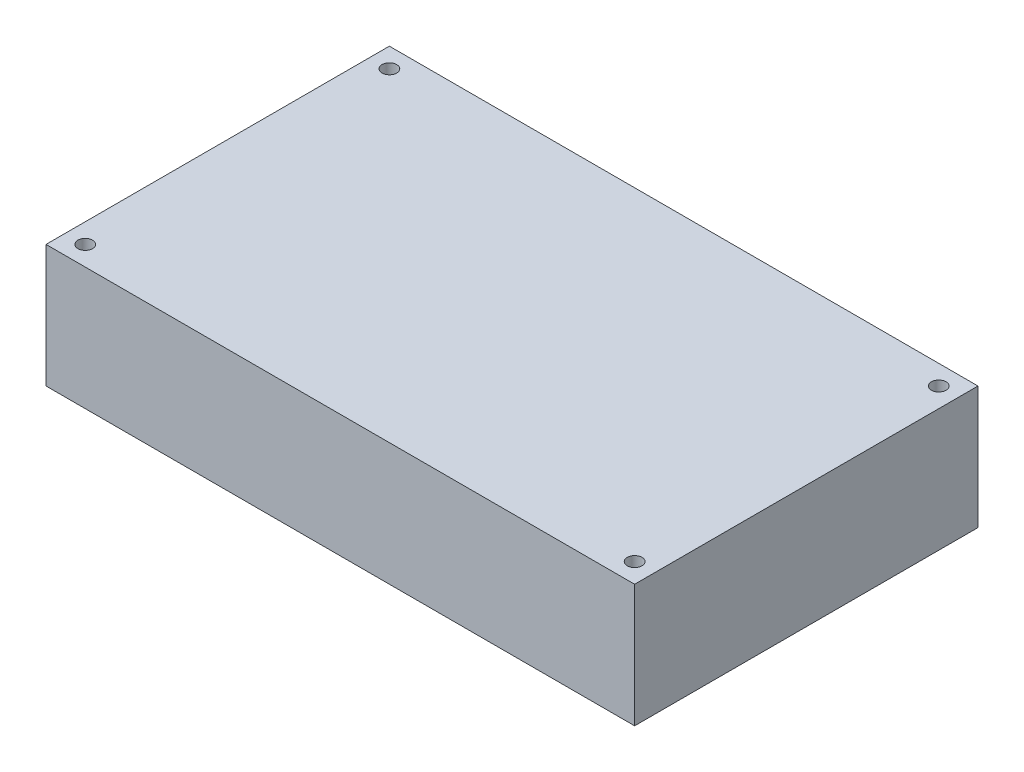
ISO-10303-21;
HEADER;
FILE_DESCRIPTION(('STEP AP214'),'2;1');
FILE_NAME('part.step','',(''),(''),'','','');
FILE_SCHEMA(('AUTOMOTIVE_DESIGN { 1 0 10303 214 1 1 1 1 }'));
ENDSEC;
DATA;
#1=APPLICATION_CONTEXT('core data for automotive mechanical design processes');
#2=APPLICATION_PROTOCOL_DEFINITION('international standard','automotive_design',2000,#1);
#3=PRODUCT_CONTEXT('',#1,'mechanical');
#4=PRODUCT('Part','Part','',(#3));
#5=PRODUCT_RELATED_PRODUCT_CATEGORY('part','',(#4));
#6=PRODUCT_DEFINITION_FORMATION('','',#4);
#7=PRODUCT_DEFINITION_CONTEXT('part definition',#1,'design');
#8=PRODUCT_DEFINITION('design','',#6,#7);
#9=PRODUCT_DEFINITION_SHAPE('','',#8);
#10=(LENGTH_UNIT() NAMED_UNIT(*) SI_UNIT(.MILLI.,.METRE.));
#11=(NAMED_UNIT(*) PLANE_ANGLE_UNIT() SI_UNIT($,.RADIAN.));
#12=(NAMED_UNIT(*) SI_UNIT($,.STERADIAN.) SOLID_ANGLE_UNIT());
#13=UNCERTAINTY_MEASURE_WITH_UNIT(LENGTH_MEASURE(1.E-05),#10,'distance_accuracy_value','');
#14=(GEOMETRIC_REPRESENTATION_CONTEXT(3) GLOBAL_UNCERTAINTY_ASSIGNED_CONTEXT((#13)) GLOBAL_UNIT_ASSIGNED_CONTEXT((#10,
#11,#12)) REPRESENTATION_CONTEXT('',''));
#15=CARTESIAN_POINT('',(0.,0.,0.));
#16=DIRECTION('',(0.,0.,1.));
#17=DIRECTION('',(1.,0.,0.));
#18=AXIS2_PLACEMENT_3D('',#15,#16,#17);
#19=CARTESIAN_POINT('',(60.,25.,-35.));
#20=DIRECTION('',(-1.,0.,0.));
#21=DIRECTION('',(0.,0.,1.));
#22=AXIS2_PLACEMENT_3D('',#19,#20,#21);
#23=PLANE('',#22);
#24=DIRECTION('',(0.,0.,-1.));
#25=VECTOR('',#24,1.);
#26=CARTESIAN_POINT('',(60.,0.,-35.));
#27=LINE('',#26,#25);
#28=CARTESIAN_POINT('',(60.,0.,35.));
#29=VERTEX_POINT('',#28);
#30=CARTESIAN_POINT('',(60.,0.,-35.));
#31=VERTEX_POINT('',#30);
#32=EDGE_CURVE('E104',#29,#31,#27,.T.);
#33=ORIENTED_EDGE('',*,*,#32,.T.);
#34=DIRECTION('',(0.,-1.,0.));
#35=VECTOR('',#34,1.);
#36=CARTESIAN_POINT('',(60.,25.,-35.));
#37=LINE('',#36,#35);
#38=CARTESIAN_POINT('',(60.,25.,-35.));
#39=VERTEX_POINT('',#38);
#40=EDGE_CURVE('E11',#39,#31,#37,.T.);
#41=ORIENTED_EDGE('',*,*,#40,.F.);
#42=DIRECTION('',(0.,0.,-1.));
#43=VECTOR('',#42,1.);
#44=CARTESIAN_POINT('',(60.,25.,-35.));
#45=LINE('',#44,#43);
#46=CARTESIAN_POINT('',(60.,25.,35.));
#47=VERTEX_POINT('',#46);
#48=EDGE_CURVE('E92',#47,#39,#45,.T.);
#49=ORIENTED_EDGE('',*,*,#48,.F.);
#50=DIRECTION('',(0.,-1.,0.));
#51=VECTOR('',#50,1.);
#52=CARTESIAN_POINT('',(60.,25.,35.));
#53=LINE('',#52,#51);
#54=EDGE_CURVE('E100',#47,#29,#53,.T.);
#55=ORIENTED_EDGE('',*,*,#54,.T.);
#56=EDGE_LOOP('',(#33,#41,#49,#55));
#57=FACE_BOUND('',#56,.T.);
#58=ADVANCED_FACE('F41',(#57),#23,.F.);
#59=CARTESIAN_POINT('',(-60.,25.,-35.));
#60=DIRECTION('',(0.,0.,1.));
#61=DIRECTION('',(1.,0.,0.));
#62=AXIS2_PLACEMENT_3D('',#59,#60,#61);
#63=PLANE('',#62);
#64=DIRECTION('',(-1.,0.,0.));
#65=VECTOR('',#64,1.);
#66=CARTESIAN_POINT('',(-60.,0.,-35.));
#67=LINE('',#66,#65);
#68=CARTESIAN_POINT('',(-60.,0.,-35.));
#69=VERTEX_POINT('',#68);
#70=EDGE_CURVE('E96',#31,#69,#67,.T.);
#71=ORIENTED_EDGE('',*,*,#70,.T.);
#72=DIRECTION('',(0.,-1.,0.));
#73=VECTOR('',#72,1.);
#74=CARTESIAN_POINT('',(-60.,25.,-35.));
#75=LINE('',#74,#73);
#76=CARTESIAN_POINT('',(-60.,25.,-35.));
#77=VERTEX_POINT('',#76);
#78=EDGE_CURVE('E49',#77,#69,#75,.T.);
#79=ORIENTED_EDGE('',*,*,#78,.F.);
#80=DIRECTION('',(-1.,0.,0.));
#81=VECTOR('',#80,1.);
#82=CARTESIAN_POINT('',(-60.,25.,-35.));
#83=LINE('',#82,#81);
#84=EDGE_CURVE('E87',#39,#77,#83,.T.);
#85=ORIENTED_EDGE('',*,*,#84,.F.);
#86=ORIENTED_EDGE('',*,*,#40,.T.);
#87=EDGE_LOOP('',(#71,#79,#85,#86));
#88=FACE_BOUND('',#87,.T.);
#89=ADVANCED_FACE('F95',(#88),#63,.F.);
#90=CARTESIAN_POINT('',(-60.,25.,-35.));
#91=DIRECTION('',(1.,0.,0.));
#92=DIRECTION('',(0.,0.,-1.));
#93=AXIS2_PLACEMENT_3D('',#90,#91,#92);
#94=PLANE('',#93);
#95=DIRECTION('',(0.,0.,1.));
#96=VECTOR('',#95,1.);
#97=CARTESIAN_POINT('',(-60.,0.,-35.));
#98=LINE('',#97,#96);
#99=CARTESIAN_POINT('',(-60.,0.,35.));
#100=VERTEX_POINT('',#99);
#101=EDGE_CURVE('E74',#69,#100,#98,.T.);
#102=ORIENTED_EDGE('',*,*,#101,.T.);
#103=DIRECTION('',(0.,-1.,0.));
#104=VECTOR('',#103,1.);
#105=CARTESIAN_POINT('',(-60.,25.,35.));
#106=LINE('',#105,#104);
#107=CARTESIAN_POINT('',(-60.,25.,35.));
#108=VERTEX_POINT('',#107);
#109=EDGE_CURVE('E97',#108,#100,#106,.T.);
#110=ORIENTED_EDGE('',*,*,#109,.F.);
#111=DIRECTION('',(0.,0.,1.));
#112=VECTOR('',#111,1.);
#113=CARTESIAN_POINT('',(-60.,25.,-35.));
#114=LINE('',#113,#112);
#115=EDGE_CURVE('E90',#77,#108,#114,.T.);
#116=ORIENTED_EDGE('',*,*,#115,.F.);
#117=ORIENTED_EDGE('',*,*,#78,.T.);
#118=EDGE_LOOP('',(#102,#110,#116,#117));
#119=FACE_BOUND('',#118,.T.);
#120=ADVANCED_FACE('F98',(#119),#94,.F.);
#121=CARTESIAN_POINT('',(-60.,25.,35.));
#122=DIRECTION('',(0.,0.,-1.));
#123=DIRECTION('',(-1.,0.,0.));
#124=AXIS2_PLACEMENT_3D('',#121,#122,#123);
#125=PLANE('',#124);
#126=DIRECTION('',(1.,0.,0.));
#127=VECTOR('',#126,1.);
#128=CARTESIAN_POINT('',(-60.,0.,35.));
#129=LINE('',#128,#127);
#130=EDGE_CURVE('E80',#100,#29,#129,.T.);
#131=ORIENTED_EDGE('',*,*,#130,.T.);
#132=ORIENTED_EDGE('',*,*,#54,.F.);
#133=DIRECTION('',(1.,0.,0.));
#134=VECTOR('',#133,1.);
#135=CARTESIAN_POINT('',(-60.,25.,35.));
#136=LINE('',#135,#134);
#137=EDGE_CURVE('E57',#108,#47,#136,.T.);
#138=ORIENTED_EDGE('',*,*,#137,.F.);
#139=ORIENTED_EDGE('',*,*,#109,.T.);
#140=EDGE_LOOP('',(#131,#132,#138,#139));
#141=FACE_BOUND('',#140,.T.);
#142=ADVANCED_FACE('F112',(#141),#125,.F.);
#143=CARTESIAN_POINT('',(0.,25.,0.));
#144=DIRECTION('',(0.,1.,0.));
#145=DIRECTION('',(0.,0.,1.));
#146=AXIS2_PLACEMENT_3D('',#143,#144,#145);
#147=PLANE('',#146);
#148=CARTESIAN_POINT('',(-56.,25.,31.));
#149=DIRECTION('',(0.,1.,0.));
#150=DIRECTION('',(0.,0.,1.));
#151=AXIS2_PLACEMENT_3D('',#148,#149,#150);
#152=CIRCLE('',#151,1.5);
#153=CARTESIAN_POINT('',(-56.,25.,32.5));
#154=VERTEX_POINT('',#153);
#155=EDGE_CURVE('E107',#154,#154,#152,.T.);
#156=ORIENTED_EDGE('',*,*,#155,.F.);
#157=EDGE_LOOP('',(#156));
#158=FACE_BOUND('',#157,.T.);
#159=CARTESIAN_POINT('',(56.,25.,31.));
#160=DIRECTION('',(0.,1.,0.));
#161=DIRECTION('',(0.,0.,1.));
#162=AXIS2_PLACEMENT_3D('',#159,#160,#161);
#163=CIRCLE('',#162,1.5);
#164=CARTESIAN_POINT('',(56.,25.,32.5));
#165=VERTEX_POINT('',#164);
#166=EDGE_CURVE('E120',#165,#165,#163,.T.);
#167=ORIENTED_EDGE('',*,*,#166,.F.);
#168=EDGE_LOOP('',(#167));
#169=FACE_BOUND('',#168,.T.);
#170=CARTESIAN_POINT('',(56.,25.,-31.));
#171=DIRECTION('',(0.,1.,0.));
#172=DIRECTION('',(0.,0.,1.));
#173=AXIS2_PLACEMENT_3D('',#170,#171,#172);
#174=CIRCLE('',#173,1.5);
#175=CARTESIAN_POINT('',(56.,25.,-29.5));
#176=VERTEX_POINT('',#175);
#177=EDGE_CURVE('E123',#176,#176,#174,.T.);
#178=ORIENTED_EDGE('',*,*,#177,.F.);
#179=EDGE_LOOP('',(#178));
#180=FACE_BOUND('',#179,.T.);
#181=CARTESIAN_POINT('',(-56.,25.,-31.));
#182=DIRECTION('',(0.,1.,0.));
#183=DIRECTION('',(0.,0.,1.));
#184=AXIS2_PLACEMENT_3D('',#181,#182,#183);
#185=CIRCLE('',#184,1.5);
#186=CARTESIAN_POINT('',(-56.,25.,-29.5));
#187=VERTEX_POINT('',#186);
#188=EDGE_CURVE('E126',#187,#187,#185,.T.);
#189=ORIENTED_EDGE('',*,*,#188,.F.);
#190=EDGE_LOOP('',(#189));
#191=FACE_BOUND('',#190,.T.);
#192=ORIENTED_EDGE('',*,*,#48,.T.);
#193=ORIENTED_EDGE('',*,*,#84,.T.);
#194=ORIENTED_EDGE('',*,*,#115,.T.);
#195=ORIENTED_EDGE('',*,*,#137,.T.);
#196=EDGE_LOOP('',(#192,#193,#194,#195));
#197=FACE_BOUND('',#196,.T.);
#198=ADVANCED_FACE('F88',(#158,#169,#180,#191,#197),#147,.T.);
#199=CARTESIAN_POINT('',(0.,0.,0.));
#200=DIRECTION('',(0.,1.,0.));
#201=DIRECTION('',(0.,0.,1.));
#202=AXIS2_PLACEMENT_3D('',#199,#200,#201);
#203=PLANE('',#202);
#204=CARTESIAN_POINT('',(-56.,0.,31.));
#205=DIRECTION('',(0.,1.,0.));
#206=DIRECTION('',(0.,0.,1.));
#207=AXIS2_PLACEMENT_3D('',#204,#205,#206);
#208=CIRCLE('',#207,1.5);
#209=CARTESIAN_POINT('',(-56.,0.,32.5));
#210=VERTEX_POINT('',#209);
#211=EDGE_CURVE('E133',#210,#210,#208,.T.);
#212=ORIENTED_EDGE('',*,*,#211,.T.);
#213=EDGE_LOOP('',(#212));
#214=FACE_BOUND('',#213,.T.);
#215=CARTESIAN_POINT('',(56.,0.,31.));
#216=DIRECTION('',(0.,1.,0.));
#217=DIRECTION('',(0.,0.,1.));
#218=AXIS2_PLACEMENT_3D('',#215,#216,#217);
#219=CIRCLE('',#218,1.5);
#220=CARTESIAN_POINT('',(56.,0.,32.5));
#221=VERTEX_POINT('',#220);
#222=EDGE_CURVE('E136',#221,#221,#219,.T.);
#223=ORIENTED_EDGE('',*,*,#222,.T.);
#224=EDGE_LOOP('',(#223));
#225=FACE_BOUND('',#224,.T.);
#226=CARTESIAN_POINT('',(56.,0.,-31.));
#227=DIRECTION('',(0.,1.,0.));
#228=DIRECTION('',(0.,0.,1.));
#229=AXIS2_PLACEMENT_3D('',#226,#227,#228);
#230=CIRCLE('',#229,1.5);
#231=CARTESIAN_POINT('',(56.,0.,-29.5));
#232=VERTEX_POINT('',#231);
#233=EDGE_CURVE('E132',#232,#232,#230,.T.);
#234=ORIENTED_EDGE('',*,*,#233,.T.);
#235=EDGE_LOOP('',(#234));
#236=FACE_BOUND('',#235,.T.);
#237=CARTESIAN_POINT('',(-56.,0.,-31.));
#238=DIRECTION('',(0.,1.,0.));
#239=DIRECTION('',(0.,0.,1.));
#240=AXIS2_PLACEMENT_3D('',#237,#238,#239);
#241=CIRCLE('',#240,1.5);
#242=CARTESIAN_POINT('',(-56.,0.,-29.5));
#243=VERTEX_POINT('',#242);
#244=EDGE_CURVE('E129',#243,#243,#241,.T.);
#245=ORIENTED_EDGE('',*,*,#244,.T.);
#246=EDGE_LOOP('',(#245));
#247=FACE_BOUND('',#246,.T.);
#248=ORIENTED_EDGE('',*,*,#32,.F.);
#249=ORIENTED_EDGE('',*,*,#130,.F.);
#250=ORIENTED_EDGE('',*,*,#101,.F.);
#251=ORIENTED_EDGE('',*,*,#70,.F.);
#252=EDGE_LOOP('',(#248,#249,#250,#251));
#253=FACE_BOUND('',#252,.T.);
#254=ADVANCED_FACE('F115',(#214,#225,#236,#247,#253),#203,.F.);
#255=CARTESIAN_POINT('',(-56.,0.,-31.));
#256=DIRECTION('',(0.,1.,0.));
#257=DIRECTION('',(0.,0.,1.));
#258=AXIS2_PLACEMENT_3D('',#255,#256,#257);
#259=CYLINDRICAL_SURFACE('',#258,1.5);
#260=ORIENTED_EDGE('',*,*,#188,.T.);
#261=EDGE_LOOP('',(#260));
#262=FACE_BOUND('',#261,.T.);
#263=ORIENTED_EDGE('',*,*,#244,.F.);
#264=EDGE_LOOP('',(#263));
#265=FACE_BOUND('',#264,.T.);
#266=ADVANCED_FACE('F147',(#262,#265),#259,.F.);
#267=CARTESIAN_POINT('',(56.,0.,-31.));
#268=DIRECTION('',(0.,1.,0.));
#269=DIRECTION('',(0.,0.,1.));
#270=AXIS2_PLACEMENT_3D('',#267,#268,#269);
#271=CYLINDRICAL_SURFACE('',#270,1.5);
#272=ORIENTED_EDGE('',*,*,#177,.T.);
#273=EDGE_LOOP('',(#272));
#274=FACE_BOUND('',#273,.T.);
#275=ORIENTED_EDGE('',*,*,#233,.F.);
#276=EDGE_LOOP('',(#275));
#277=FACE_BOUND('',#276,.T.);
#278=ADVANCED_FACE('F144',(#274,#277),#271,.F.);
#279=CARTESIAN_POINT('',(56.,0.,31.));
#280=DIRECTION('',(0.,1.,0.));
#281=DIRECTION('',(0.,0.,1.));
#282=AXIS2_PLACEMENT_3D('',#279,#280,#281);
#283=CYLINDRICAL_SURFACE('',#282,1.5);
#284=ORIENTED_EDGE('',*,*,#166,.T.);
#285=EDGE_LOOP('',(#284));
#286=FACE_BOUND('',#285,.T.);
#287=ORIENTED_EDGE('',*,*,#222,.F.);
#288=EDGE_LOOP('',(#287));
#289=FACE_BOUND('',#288,.T.);
#290=ADVANCED_FACE('F146',(#286,#289),#283,.F.);
#291=CARTESIAN_POINT('',(-56.,0.,31.));
#292=DIRECTION('',(0.,1.,0.));
#293=DIRECTION('',(0.,0.,1.));
#294=AXIS2_PLACEMENT_3D('',#291,#292,#293);
#295=CYLINDRICAL_SURFACE('',#294,1.5);
#296=ORIENTED_EDGE('',*,*,#155,.T.);
#297=EDGE_LOOP('',(#296));
#298=FACE_BOUND('',#297,.T.);
#299=ORIENTED_EDGE('',*,*,#211,.F.);
#300=EDGE_LOOP('',(#299));
#301=FACE_BOUND('',#300,.T.);
#302=ADVANCED_FACE('F154',(#298,#301),#295,.F.);
#303=CLOSED_SHELL('',(#58,#89,#120,#142,#198,#254,#266,#278,#290,#302));
#304=MANIFOLD_SOLID_BREP('B2',#303);
#305=ADVANCED_BREP_SHAPE_REPRESENTATION('',(#18,#304),#14);
#306=SHAPE_DEFINITION_REPRESENTATION(#9,#305);
ENDSEC;
END-ISO-10303-21;
